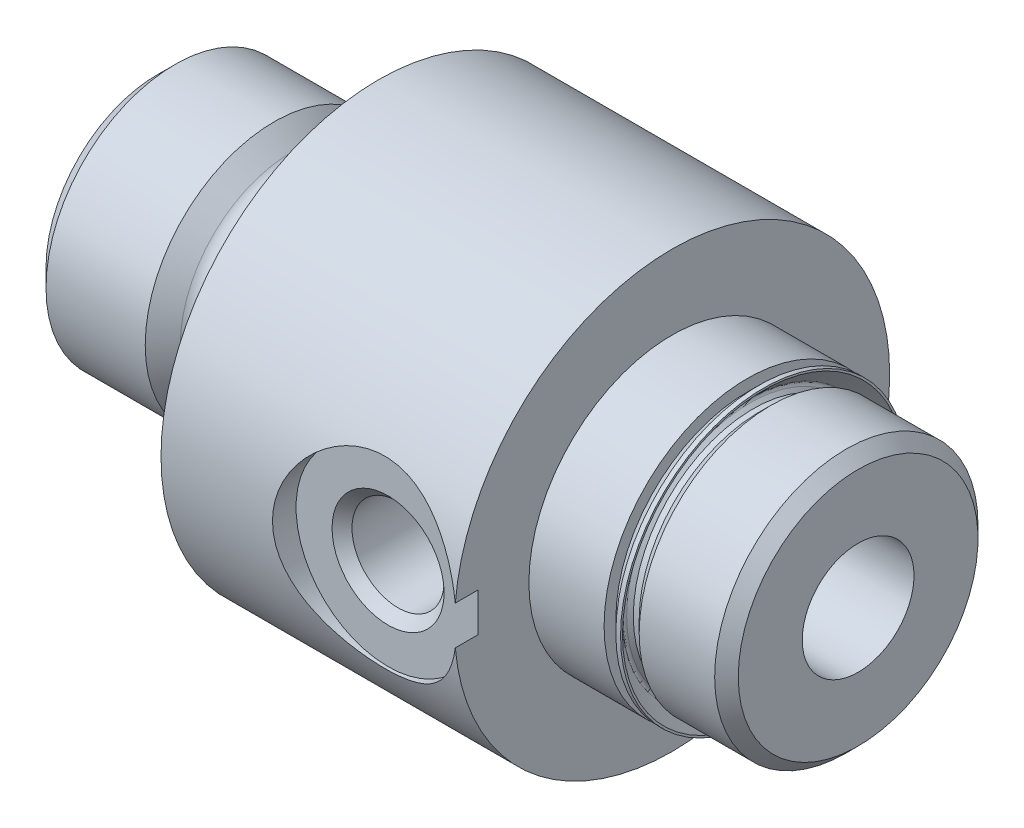
ISO-10303-21;
HEADER;
FILE_DESCRIPTION(('STEP AP214'),'2;1');
FILE_NAME('part.step','',(''),(''),'','','');
FILE_SCHEMA(('AUTOMOTIVE_DESIGN { 1 0 10303 214 1 1 1 1 }'));
ENDSEC;
DATA;
#1=APPLICATION_CONTEXT('core data for automotive mechanical design processes');
#2=APPLICATION_PROTOCOL_DEFINITION('international standard','automotive_design',2000,#1);
#3=PRODUCT_CONTEXT('',#1,'mechanical');
#4=PRODUCT('Part','Part','',(#3));
#5=PRODUCT_RELATED_PRODUCT_CATEGORY('part','',(#4));
#6=PRODUCT_DEFINITION_FORMATION('','',#4);
#7=PRODUCT_DEFINITION_CONTEXT('part definition',#1,'design');
#8=PRODUCT_DEFINITION('design','',#6,#7);
#9=PRODUCT_DEFINITION_SHAPE('','',#8);
#10=(LENGTH_UNIT() NAMED_UNIT(*) SI_UNIT(.MILLI.,.METRE.));
#11=(NAMED_UNIT(*) PLANE_ANGLE_UNIT() SI_UNIT($,.RADIAN.));
#12=(NAMED_UNIT(*) SI_UNIT($,.STERADIAN.) SOLID_ANGLE_UNIT());
#13=UNCERTAINTY_MEASURE_WITH_UNIT(LENGTH_MEASURE(1.E-05),#10,'distance_accuracy_value','');
#14=(GEOMETRIC_REPRESENTATION_CONTEXT(3) GLOBAL_UNCERTAINTY_ASSIGNED_CONTEXT((#13)) GLOBAL_UNIT_ASSIGNED_CONTEXT((#10,
#11,#12)) REPRESENTATION_CONTEXT('',''));
#15=CARTESIAN_POINT('',(0.,0.,0.));
#16=DIRECTION('',(0.,0.,1.));
#17=DIRECTION('',(1.,0.,0.));
#18=AXIS2_PLACEMENT_3D('',#15,#16,#17);
#19=CARTESIAN_POINT('',(25.4,9.3726,0.));
#20=DIRECTION('',(-1.,0.,0.));
#21=DIRECTION('',(0.,0.,1.));
#22=AXIS2_PLACEMENT_3D('',#19,#20,#21);
#23=PLANE('',#22);
#24=CARTESIAN_POINT('',(25.4,0.,0.));
#25=DIRECTION('',(-1.,0.,0.));
#26=DIRECTION('',(0.,0.,1.));
#27=AXIS2_PLACEMENT_3D('',#24,#25,#26);
#28=CIRCLE('',#27,6.16585);
#29=CARTESIAN_POINT('',(25.4,0.,6.16585));
#30=VERTEX_POINT('',#29);
#31=EDGE_CURVE('E555',#30,#30,#28,.T.);
#32=ORIENTED_EDGE('',*,*,#31,.F.);
#33=EDGE_LOOP('',(#32));
#34=FACE_BOUND('',#33,.T.);
#35=CARTESIAN_POINT('',(25.4,0.,0.));
#36=DIRECTION('',(-1.,0.,0.));
#37=DIRECTION('',(0.,0.,1.));
#38=AXIS2_PLACEMENT_3D('',#35,#36,#37);
#39=CIRCLE('',#38,5.6603386855597);
#40=CARTESIAN_POINT('',(25.4,0.,5.6603386855597));
#41=VERTEX_POINT('',#40);
#42=EDGE_CURVE('E11',#41,#41,#39,.F.);
#43=ORIENTED_EDGE('',*,*,#42,.F.);
#44=EDGE_LOOP('',(#43));
#45=FACE_BOUND('',#44,.T.);
#46=ADVANCED_FACE('F38',(#34,#45),#23,.F.);
#47=CARTESIAN_POINT('',(30.1752,0.,0.));
#48=DIRECTION('',(-1.,0.,0.));
#49=DIRECTION('',(0.,0.,1.));
#50=AXIS2_PLACEMENT_3D('',#47,#48,#49);
#51=CYLINDRICAL_SURFACE('',#50,5.16255);
#52=CARTESIAN_POINT('',(25.908,0.,0.));
#53=DIRECTION('',(-1.,0.,0.));
#54=DIRECTION('',(0.,0.,1.));
#55=AXIS2_PLACEMENT_3D('',#52,#53,#54);
#56=CIRCLE('',#55,5.16255);
#57=CARTESIAN_POINT('',(25.908,0.,5.16255));
#58=VERTEX_POINT('',#57);
#59=EDGE_CURVE('E106',#58,#58,#56,.T.);
#60=ORIENTED_EDGE('',*,*,#59,.T.);
#61=EDGE_LOOP('',(#60));
#62=FACE_BOUND('',#61,.T.);
#63=CARTESIAN_POINT('',(25.654,0.,0.));
#64=DIRECTION('',(-1.,0.,0.));
#65=DIRECTION('',(0.,0.,1.));
#66=AXIS2_PLACEMENT_3D('',#63,#64,#65);
#67=CIRCLE('',#66,5.16255);
#68=CARTESIAN_POINT('',(25.654,0.,5.16255));
#69=VERTEX_POINT('',#68);
#70=EDGE_CURVE('E46',#69,#69,#67,.T.);
#71=ORIENTED_EDGE('',*,*,#70,.F.);
#72=EDGE_LOOP('',(#71));
#73=FACE_BOUND('',#72,.T.);
#74=ADVANCED_FACE('F172',(#62,#73),#51,.T.);
#75=CARTESIAN_POINT('',(30.1752,0.,0.));
#76=DIRECTION('',(-1.,0.,0.));
#77=DIRECTION('',(0.,0.,1.));
#78=AXIS2_PLACEMENT_3D('',#75,#76,#77);
#79=CYLINDRICAL_SURFACE('',#78,9.3726);
#80=CARTESIAN_POINT('',(9.525,0.,0.));
#81=DIRECTION('',(-1.,0.,0.));
#82=DIRECTION('',(0.,0.,1.));
#83=AXIS2_PLACEMENT_3D('',#80,#81,#82);
#84=CIRCLE('',#83,9.3726);
#85=CARTESIAN_POINT('',(9.525,0.,9.3726));
#86=VERTEX_POINT('',#85);
#87=EDGE_CURVE('E109',#86,#86,#84,.T.);
#88=ORIENTED_EDGE('',*,*,#87,.F.);
#89=EDGE_LOOP('',(#88));
#90=FACE_BOUND('',#89,.T.);
#91=CARTESIAN_POINT('',(22.1615,0.,0.));
#92=DIRECTION('',(1.,0.,0.));
#93=DIRECTION('',(0.,0.,-1.));
#94=AXIS2_PLACEMENT_3D('',#91,#92,#93);
#95=CIRCLE('',#94,9.3726);
#96=CARTESIAN_POINT('',(22.1615,-0.834632559872902,9.33536390560111));
#97=VERTEX_POINT('',#96);
#98=CARTESIAN_POINT('',(22.1615,0.834632559872902,9.33536390560111));
#99=VERTEX_POINT('',#98);
#100=EDGE_CURVE('E75',#97,#99,#95,.T.);
#101=ORIENTED_EDGE('',*,*,#100,.F.);
#102=CARTESIAN_POINT('',(14.3256,0.,9.3726));
#103=CARTESIAN_POINT('',(14.3256007847787,-0.106034358499214,9.37259937566318));
#104=CARTESIAN_POINT('',(14.3298622196159,-0.212102984455135,9.3707955936407));
#105=CARTESIAN_POINT('',(14.3468664680338,-0.423481617946176,9.36362607527876));
#106=CARTESIAN_POINT('',(14.3596145368135,-0.528791114534977,9.35825813190039));
#107=CARTESIAN_POINT('',(14.3934972849969,-0.738045737542348,9.34408523623956));
#108=CARTESIAN_POINT('',(14.4146488451403,-0.84198767998823,9.33527336646095));
#109=CARTESIAN_POINT('',(14.4651133095554,-1.047556732083,9.31444901697212));
#110=CARTESIAN_POINT('',(14.4944295496022,-1.1491828771877,9.30243522916746));
#111=CARTESIAN_POINT('',(14.5939808234609,-1.44876024555991,9.26213021499638));
#112=CARTESIAN_POINT('',(14.6759760866631,-1.64236835016573,9.22950628484626));
#113=CARTESIAN_POINT('',(14.8685029131907,-2.01278792665281,9.15587800701386));
#114=CARTESIAN_POINT('',(14.979026299258,-2.18960419188745,9.11487606149391));
#115=CARTESIAN_POINT('',(15.2315103799277,-2.53092785028021,9.0262144176742));
#116=CARTESIAN_POINT('',(15.3747035281306,-2.69446744951661,8.97833250538193));
#117=CARTESIAN_POINT('',(15.6858004227496,-2.99602975720291,8.88225999999363));
#118=CARTESIAN_POINT('',(15.8537174498351,-3.1340386611286,8.83406925439525));
#119=CARTESIAN_POINT('',(16.2200529949637,-3.38765546632028,8.74006169142934));
#120=CARTESIAN_POINT('',(16.4195903327512,-3.50176196649314,8.69449128629245));
#121=CARTESIAN_POINT('',(16.7325555755937,-3.64615779691065,8.63445846738749));
#122=CARTESIAN_POINT('',(16.8391976361349,-3.68984076712222,8.61582908095398));
#123=CARTESIAN_POINT('',(17.0563468923013,-3.76788097151651,8.58198791739158));
#124=CARTESIAN_POINT('',(17.1668520476474,-3.80224304694113,8.56677436679898));
#125=CARTESIAN_POINT('',(17.3854286113833,-3.85980930448531,8.54098642274406));
#126=CARTESIAN_POINT('',(17.4933563264975,-3.88347550429939,8.53022213383807));
#127=CARTESIAN_POINT('',(17.7110852655598,-3.92173317835287,8.51270133791138));
#128=CARTESIAN_POINT('',(17.8208855914741,-3.93632888334405,8.50594296248014));
#129=CARTESIAN_POINT('',(18.0414720758414,-3.95627332770152,8.49668487493681));
#130=CARTESIAN_POINT('',(18.1522579532592,-3.96162462325051,8.49418398558494));
#131=CARTESIAN_POINT('',(18.3738964256704,-3.96301861503271,8.49353371249745));
#132=CARTESIAN_POINT('',(18.4847490166587,-3.9590618232777,8.49538408941088));
#133=CARTESIAN_POINT('',(18.6967776343397,-3.94257539486705,8.50304680977758));
#134=CARTESIAN_POINT('',(18.7980210434599,-3.93075379546559,8.50853179372387));
#135=CARTESIAN_POINT('',(18.9990690659652,-3.89940546186072,8.52294286471688));
#136=CARTESIAN_POINT('',(19.0988731989767,-3.87987621414305,8.53187007427391));
#137=CARTESIAN_POINT('',(19.395064425887,-3.8099975930247,8.56342436671249));
#138=CARTESIAN_POINT('',(19.5884041149146,-3.74834347940313,8.59083110661853));
#139=CARTESIAN_POINT('',(19.9659678905179,-3.59548234527021,8.65592932275785));
#140=CARTESIAN_POINT('',(20.1499054263505,-3.50366659560753,8.69382987529455));
#141=CARTESIAN_POINT('',(20.5005201427297,-3.2935027659072,8.77560090245237));
#142=CARTESIAN_POINT('',(20.6671903667937,-3.17514405280551,8.81947376679529));
#143=CARTESIAN_POINT('',(20.9938083360205,-2.90314174689628,8.91290064288197));
#144=CARTESIAN_POINT('',(21.1519008510761,-2.74732059971406,8.96261635498035));
#145=CARTESIAN_POINT('',(21.4403457825917,-2.41089919834485,9.05890665358331));
#146=CARTESIAN_POINT('',(21.5706913156109,-2.23029281369719,9.10548045869415));
#147=CARTESIAN_POINT('',(21.80276908749,-1.84365060297926,9.19166489143267));
#148=CARTESIAN_POINT('',(21.9037256425793,-1.63710186384783,9.23107791130031));
#149=CARTESIAN_POINT('',(22.0688038134091,-1.20785984604516,9.29697422744739));
#150=CARTESIAN_POINT('',(22.1329464027726,-0.985175841556649,9.32346488455126));
#151=CARTESIAN_POINT('',(22.2186447532593,-0.545464501651219,9.35914407576109));
#152=CARTESIAN_POINT('',(22.2426880380652,-0.329003802639671,9.3693414330515));
#153=CARTESIAN_POINT('',(22.2549478079582,0.105082870642388,9.37452109542313));
#154=CARTESIAN_POINT('',(22.2431749678006,0.322708478420073,9.36950793389846));
#155=CARTESIAN_POINT('',(22.1858986104506,0.74115718387465,9.34548143638236));
#156=CARTESIAN_POINT('',(22.1421605486744,0.9422688774786,9.32720120121325));
#157=CARTESIAN_POINT('',(22.0246723649868,1.33406825074195,9.2792711223997));
#158=CARTESIAN_POINT('',(21.9509184796571,1.52475461986018,9.24961985306888));
#159=CARTESIAN_POINT('',(21.7730918070278,1.89700591684725,9.18063010098873));
#160=CARTESIAN_POINT('',(21.6681457193431,2.07810133208088,9.1410185012849));
#161=CARTESIAN_POINT('',(21.4318603483895,2.42076517973475,9.05630886266345));
#162=CARTESIAN_POINT('',(21.300509911422,2.58232531373687,9.01120850837924));
#163=CARTESIAN_POINT('',(21.003904789252,2.89380065179376,8.91627603472376));
#164=CARTESIAN_POINT('',(20.8368681781874,3.04198825237481,8.86633971574651));
#165=CARTESIAN_POINT('',(20.4794060261673,3.30877984848916,8.77027752301089));
#166=CARTESIAN_POINT('',(20.2889745970776,3.42737637352229,8.72415261343456));
#167=CARTESIAN_POINT('',(19.9877123420964,3.58114963365137,8.66164675652079));
#168=CARTESIAN_POINT('',(19.8837424689045,3.62868320436492,8.64178649774071));
#169=CARTESIAN_POINT('',(19.6716285884866,3.71473583311274,8.60514713930564));
#170=CARTESIAN_POINT('',(19.5634864517969,3.7532588773318,8.5883666778831));
#171=CARTESIAN_POINT('',(19.3438523618734,3.82086248256759,8.5585050094943));
#172=CARTESIAN_POINT('',(19.2323620641027,3.84994762873044,8.54542200661824));
#173=CARTESIAN_POINT('',(19.0068747033238,3.89834886124254,8.52345096572075));
#174=CARTESIAN_POINT('',(18.8928778871937,3.91766590523833,8.5145625164788));
#175=CARTESIAN_POINT('',(18.6724421910215,3.94514427064224,8.50186310792561));
#176=CARTESIAN_POINT('',(18.5661174435465,3.95406614678074,8.4977065856986));
#177=CARTESIAN_POINT('',(18.3529758820266,3.96330349290157,8.49340229610692));
#178=CARTESIAN_POINT('',(18.2461589153982,3.96361608542046,8.49325586902833));
#179=CARTESIAN_POINT('',(18.0329711152585,3.95562145805438,8.49698249796804));
#180=CARTESIAN_POINT('',(17.926600073458,3.94731885439651,8.50085340140526));
#181=CARTESIAN_POINT('',(17.7150678249933,3.9222096307706,8.51246621756775));
#182=CARTESIAN_POINT('',(17.6099070895817,3.90539980579485,8.52020958919237));
#183=CARTESIAN_POINT('',(17.3078223601974,3.84454501999023,8.54792993887305));
#184=CARTESIAN_POINT('',(17.1134072337252,3.7896017896873,8.57264650225012));
#185=CARTESIAN_POINT('',(16.7366412962004,3.65161072464814,8.63232020298238));
#186=CARTESIAN_POINT('',(16.5542939130555,3.56855494500744,8.66728023487472));
#187=CARTESIAN_POINT('',(16.1945160861522,3.37084095678001,8.74614398831467));
#188=CARTESIAN_POINT('',(16.0180666548569,3.25456202561234,8.7904636297753));
#189=CARTESIAN_POINT('',(15.686257122934,2.99597602169914,8.88192435734578));
#190=CARTESIAN_POINT('',(15.5309047121298,2.85365950243174,8.92906646326531));
#191=CARTESIAN_POINT('',(15.2334666352567,2.5340734747181,9.02518056300412));
#192=CARTESIAN_POINT('',(15.0932831239778,2.35497080112409,9.07401983200871));
#193=CARTESIAN_POINT('',(14.9070655804226,2.0695103371712,9.14179442064448));
#194=CARTESIAN_POINT('',(14.8489648991632,1.97146837114246,9.16348744685256));
#195=CARTESIAN_POINT('',(14.7412523341999,1.77036195605496,9.20445279877424));
#196=CARTESIAN_POINT('',(14.6916365298898,1.66729985508876,9.22372624140392));
#197=CARTESIAN_POINT('',(14.6020348722108,1.45842374574955,9.25903268180572));
#198=CARTESIAN_POINT('',(14.5619152103807,1.35267458075306,9.27511012065244));
#199=CARTESIAN_POINT('',(14.4907756491453,1.1377620524598,9.3039169912351));
#200=CARTESIAN_POINT('',(14.4597514188693,1.02860034156869,9.31664801609623));
#201=CARTESIAN_POINT('',(14.407191081519,0.807941947314301,9.33836834936601));
#202=CARTESIAN_POINT('',(14.3856316981371,0.696451706531074,9.34736683393452));
#203=CARTESIAN_POINT('',(14.352157718539,0.471841882197909,9.36139082530379));
#204=CARTESIAN_POINT('',(14.3402361248841,0.358723541560575,9.36641921449781));
#205=CARTESIAN_POINT('',(14.3306672475396,0.204467796659971,9.37045872790099));
#206=CARTESIAN_POINT('',(14.3287675903542,0.163603255935182,9.3712612309043));
#207=CARTESIAN_POINT('',(14.3262338123357,0.0818275111064659,9.37233198860922));
#208=CARTESIAN_POINT('',(14.3255996971713,0.040916306794336,9.37260024091773));
#209=CARTESIAN_POINT('',(14.3256,0.,9.3726));
#210=B_SPLINE_CURVE_WITH_KNOTS('',3,(#102,#103,#104,#105,#106,#107,#108,#109,#110,#111,#112,
#113,#114,#115,#116,#117,#118,#119,#120,#121,#122,#123,#124,#125,#126,#127,#128,#129,#130,#131,
#132,#133,#134,#135,#136,#137,#138,#139,#140,#141,#142,#143,#144,#145,#146,#147,#148,#149,#150,
#151,#152,#153,#154,#155,#156,#157,#158,#159,#160,#161,#162,#163,#164,#165,#166,#167,#168,#169,
#170,#171,#172,#173,#174,#175,#176,#177,#178,#179,#180,#181,#182,#183,#184,#185,#186,#187,#188,
#189,#190,#191,#192,#193,#194,#195,#196,#197,#198,#199,#200,#201,#202,#203,#204,#205,#206,#207,
#208,#209),.UNSPECIFIED.,.T.,.F.,(4,2,2,2,2,2,2,2,2,2,2,2,2,2,2,2,2,2,2,2,2,2,2,2,2,2,2,2,2,2,2,
2,2,2,2,2,2,2,2,2,2,2,2,2,2,2,2,2,2,2,2,2,2,4),(0.,0.31806136029308,0.636319857927257,
0.955220924765885,1.27425247397355,1.90943264637467,2.54443095348157,3.20924541455145,
3.8744182988083,4.5735147959008,4.92333301990614,5.27296920005555,5.60557252582808,
5.9380205987319,6.27037673129926,6.60271458231539,6.90857783121968,7.21454090664446,
7.82595016004589,8.45054656629703,9.07539363314262,9.7547569718634,10.4342886503873,
11.1303992868044,11.8261129409511,12.476800477427,13.1272940998562,13.744341268528,
14.3614658271275,14.9978241714309,15.6344518925947,16.317852194927,17.0014248528782,
17.3491378472873,17.6966967240738,18.0440864951456,18.3914422021649,18.711364938466,
19.0313946005989,19.3512528717289,19.6712317359617,20.2789144211783,20.8867689875549,
21.5317600350213,22.1769855530572,22.8711881202821,23.2188606756693,23.5663721454022,
23.9086486211141,24.2507618531424,24.5920289689755,24.9330480875174,25.055780361164,
25.1785131845749),.UNSPECIFIED.);
#211=EDGE_CURVE('E68',#99,#97,#210,.T.);
#212=ORIENTED_EDGE('',*,*,#211,.F.);
#213=EDGE_LOOP('',(#101,#212));
#214=FACE_BOUND('',#213,.T.);
#215=ADVANCED_FACE('F178',(#90,#214),#79,.T.);
#216=CARTESIAN_POINT('',(18.288,0.,9.3726));
#217=DIRECTION('',(0.,0.,-1.));
#218=DIRECTION('',(-1.,0.,0.));
#219=AXIS2_PLACEMENT_3D('',#216,#217,#218);
#220=CYLINDRICAL_SURFACE('',#219,3.9624);
#221=ORIENTED_EDGE('',*,*,#211,.T.);
#222=DIRECTION('',(0.,0.,-1.));
#223=VECTOR('',#222,1.);
#224=CARTESIAN_POINT('',(22.1615,-0.834632559872902,9.3726));
#225=LINE('',#224,#223);
#226=CARTESIAN_POINT('',(22.1615,-0.834632559872902,8.3566));
#227=VERTEX_POINT('',#226);
#228=EDGE_CURVE('E58',#97,#227,#225,.T.);
#229=ORIENTED_EDGE('',*,*,#228,.T.);
#230=CARTESIAN_POINT('',(18.288,0.,8.3566));
#231=DIRECTION('',(0.,0.,-1.));
#232=DIRECTION('',(-1.,0.,0.));
#233=AXIS2_PLACEMENT_3D('',#230,#231,#232);
#234=CIRCLE('',#233,3.9624);
#235=CARTESIAN_POINT('',(22.1615,0.834632559872902,8.3566));
#236=VERTEX_POINT('',#235);
#237=EDGE_CURVE('E73',#227,#236,#234,.T.);
#238=ORIENTED_EDGE('',*,*,#237,.T.);
#239=DIRECTION('',(0.,0.,-1.));
#240=VECTOR('',#239,1.);
#241=CARTESIAN_POINT('',(22.1615,0.834632559872902,9.3726));
#242=LINE('',#241,#240);
#243=EDGE_CURVE('E53',#236,#99,#242,.F.);
#244=ORIENTED_EDGE('',*,*,#243,.T.);
#245=EDGE_LOOP('',(#221,#229,#238,#244));
#246=FACE_BOUND('',#245,.T.);
#247=ADVANCED_FACE('F72',(#246),#220,.F.);
#248=CARTESIAN_POINT('',(20.701,0.,8.3566));
#249=DIRECTION('',(0.,0.,1.));
#250=DIRECTION('',(1.,0.,0.));
#251=AXIS2_PLACEMENT_3D('',#248,#249,#250);
#252=PLANE('',#251);
#253=CARTESIAN_POINT('',(18.288,0.,8.3566));
#254=DIRECTION('',(0.,0.,-1.));
#255=DIRECTION('',(-1.,0.,0.));
#256=AXIS2_PLACEMENT_3D('',#253,#254,#255);
#257=CIRCLE('',#256,2.413);
#258=CARTESIAN_POINT('',(15.875,0.,8.3566));
#259=VERTEX_POINT('',#258);
#260=EDGE_CURVE('E78',#259,#259,#257,.T.);
#261=ORIENTED_EDGE('',*,*,#260,.T.);
#262=EDGE_LOOP('',(#261));
#263=FACE_BOUND('',#262,.T.);
#264=ORIENTED_EDGE('',*,*,#237,.F.);
#265=DIRECTION('',(0.,1.,0.));
#266=VECTOR('',#265,1.);
#267=CARTESIAN_POINT('',(22.1615,0.,8.3566));
#268=LINE('',#267,#266);
#269=EDGE_CURVE('E63',#227,#236,#268,.T.);
#270=ORIENTED_EDGE('',*,*,#269,.T.);
#271=EDGE_LOOP('',(#264,#270));
#272=FACE_BOUND('',#271,.T.);
#273=ADVANCED_FACE('F77',(#263,#272),#252,.T.);
#274=CARTESIAN_POINT('',(0.,0.,0.));
#275=DIRECTION('',(-1.,0.,0.));
#276=DIRECTION('',(0.,0.,1.));
#277=AXIS2_PLACEMENT_3D('',#274,#275,#276);
#278=CYLINDRICAL_SURFACE('',#277,2.40665);
#279=CARTESIAN_POINT('',(0.507999999999998,0.,0.));
#280=DIRECTION('',(-1.,0.,0.));
#281=DIRECTION('',(0.,0.,1.));
#282=AXIS2_PLACEMENT_3D('',#279,#280,#281);
#283=CIRCLE('',#282,2.40665);
#284=CARTESIAN_POINT('',(0.507999999999998,0.,2.40665));
#285=VERTEX_POINT('',#284);
#286=EDGE_CURVE('E91',#285,#285,#283,.T.);
#287=ORIENTED_EDGE('',*,*,#286,.T.);
#288=EDGE_LOOP('',(#287));
#289=FACE_BOUND('',#288,.T.);
#290=CARTESIAN_POINT('',(30.1752,0.,0.));
#291=DIRECTION('',(-1.,0.,0.));
#292=DIRECTION('',(0.,0.,1.));
#293=AXIS2_PLACEMENT_3D('',#290,#291,#292);
#294=CIRCLE('',#293,2.40665);
#295=CARTESIAN_POINT('',(30.1752,0.,2.40665));
#296=VERTEX_POINT('',#295);
#297=EDGE_CURVE('E94',#296,#296,#294,.T.);
#298=ORIENTED_EDGE('',*,*,#297,.F.);
#299=EDGE_LOOP('',(#298));
#300=FACE_BOUND('',#299,.T.);
#301=CARTESIAN_POINT('',(20.27174,0.,2.40665));
#302=CARTESIAN_POINT('',(20.271732083611,-0.0944665266148716,2.40664227817569));
#303=CARTESIAN_POINT('',(20.264938281244,-0.189022688118429,2.40103400474687));
#304=CARTESIAN_POINT('',(20.2382407274094,-0.375036425841801,2.37910138201514));
#305=CARTESIAN_POINT('',(20.2183171046315,-0.466489084126016,2.36276079002454));
#306=CARTESIAN_POINT('',(20.1668351040403,-0.643131246397744,2.32089161849654));
#307=CARTESIAN_POINT('',(20.1353493880645,-0.728355963070287,2.2954204433231));
#308=CARTESIAN_POINT('',(20.0623471352527,-0.891585964550188,2.2370893523968));
#309=CARTESIAN_POINT('',(20.0208287598189,-0.969589922444067,2.20422808240251));
#310=CARTESIAN_POINT('',(19.9126422340187,-1.14447786819001,2.12005822248041));
#311=CARTESIAN_POINT('',(19.84231266377,-1.23795870823166,2.06638022030208));
#312=CARTESIAN_POINT('',(19.6885321536435,-1.40964208958544,1.95332961471516));
#313=CARTESIAN_POINT('',(19.605044209136,-1.48780010470502,1.89394114145529));
#314=CARTESIAN_POINT('',(19.4247395722244,-1.62986684612,1.7732117342424));
#315=CARTESIAN_POINT('',(19.3277125761668,-1.69349798625319,1.71185485552847));
#316=CARTESIAN_POINT('',(19.1731185392029,-1.77628372716905,1.62431828701695));
#317=CARTESIAN_POINT('',(19.1201234563902,-1.80175375812465,1.59590978250623));
#318=CARTESIAN_POINT('',(19.0109356834055,-1.84827208038185,1.54179133245285));
#319=CARTESIAN_POINT('',(18.9547457937074,-1.86932417063162,1.51607907802767));
#320=CARTESIAN_POINT('',(18.8327470222155,-1.90866811307985,1.46630957139255));
#321=CARTESIAN_POINT('',(18.7665560734158,-1.92641232979909,1.44273489310753));
#322=CARTESIAN_POINT('',(18.6305316382863,-1.9551740221339,1.40351601713772));
#323=CARTESIAN_POINT('',(18.5607076586563,-1.96620818141848,1.38785216681842));
#324=CARTESIAN_POINT('',(18.4178340368811,-1.98079801512445,1.36696168575298));
#325=CARTESIAN_POINT('',(18.3447571077889,-1.98426892569323,1.36185338708202));
#326=CARTESIAN_POINT('',(18.1988046589964,-1.98307846450031,1.36358448122014));
#327=CARTESIAN_POINT('',(18.1259292089748,-1.97841456417784,1.37042758891142));
#328=CARTESIAN_POINT('',(17.975358232337,-1.96057100804832,1.39584227330882));
#329=CARTESIAN_POINT('',(17.8979733448864,-1.94653915010945,1.41558282154709));
#330=CARTESIAN_POINT('',(17.7479520114763,-1.91038435433696,1.46400011383435));
#331=CARTESIAN_POINT('',(17.6753317190683,-1.88823541539069,1.49270553050759));
#332=CARTESIAN_POINT('',(17.5504563216836,-1.84246025373771,1.54864974648624));
#333=CARTESIAN_POINT('',(17.4972078363799,-1.82020377099369,1.57484894727814));
#334=CARTESIAN_POINT('',(17.3936774155696,-1.77163222700846,1.62930009150415));
#335=CARTESIAN_POINT('',(17.3433971377681,-1.74531492695382,1.65755316270792));
#336=CARTESIAN_POINT('',(17.1967539967516,-1.66047944683466,1.74392035275729));
#337=CARTESIAN_POINT('',(17.1046436972852,-1.59609827564095,1.80361560683221));
#338=CARTESIAN_POINT('',(16.9281467643951,-1.44906291232317,1.92396686313827));
#339=CARTESIAN_POINT('',(16.8442769958811,-1.36573038709953,1.9845499210859));
#340=CARTESIAN_POINT('',(16.6909520146864,-1.18272201505033,2.09873888418448));
#341=CARTESIAN_POINT('',(16.6214630753337,-1.08308541207721,2.15236100172848));
#342=CARTESIAN_POINT('',(16.5160741514393,-0.896539089550014,2.23510750096794));
#343=CARTESIAN_POINT('',(16.4761431391089,-0.813124249591007,2.26697037376801));
#344=CARTESIAN_POINT('',(16.4076816971062,-0.639025927690315,2.32205095802317));
#345=CARTESIAN_POINT('',(16.3791434707341,-0.548347467837317,2.34527458103991));
#346=CARTESIAN_POINT('',(16.3350298297872,-0.361153707750085,2.38131666245983));
#347=CARTESIAN_POINT('',(16.3195444689695,-0.264602707750542,2.39406282048912));
#348=CARTESIAN_POINT('',(16.3030634922475,-0.0694466223280627,2.40763145906262));
#349=CARTESIAN_POINT('',(16.3020606714073,0.0291574172724828,2.40845986858087));
#350=CARTESIAN_POINT('',(16.3139132332596,0.21415061193982,2.39869783182771));
#351=CARTESIAN_POINT('',(16.3252819807325,0.3007077594501,2.38933231574157));
#352=CARTESIAN_POINT('',(16.3588599806674,0.470225803750748,2.36182736715262));
#353=CARTESIAN_POINT('',(16.3810709939627,0.553186114014716,2.34368650949867));
#354=CARTESIAN_POINT('',(16.4359440489433,0.71604040424665,2.29925727846078));
#355=CARTESIAN_POINT('',(16.4688874866116,0.795778263179254,2.27275021016908));
#356=CARTESIAN_POINT('',(16.5435922139962,0.948418008217707,2.21341031580642));
#357=CARTESIAN_POINT('',(16.5853563085294,1.02131770923345,2.18057547790508));
#358=CARTESIAN_POINT('',(16.697055807937,1.19105315632743,2.09429288698658));
#359=CARTESIAN_POINT('',(16.7711901083829,1.2838056936711,2.0382382445847));
#360=CARTESIAN_POINT('',(16.9328595831294,1.45349214275559,1.92093559938729));
#361=CARTESIAN_POINT('',(17.0204427413482,1.53036700592303,1.85966936589485));
#362=CARTESIAN_POINT('',(17.1616439843106,1.63402087437716,1.76752305857778));
#363=CARTESIAN_POINT('',(17.2108246226197,1.66686404186151,1.73649331187815));
#364=CARTESIAN_POINT('',(17.3124015352713,1.72828206801288,1.67537418004322));
#365=CARTESIAN_POINT('',(17.3647992056835,1.75685505484699,1.64528521184142));
#366=CARTESIAN_POINT('',(17.4726836163731,1.80943932818475,1.58726815784958));
#367=CARTESIAN_POINT('',(17.528157725088,1.83346770643541,1.55933221966486));
#368=CARTESIAN_POINT('',(17.6424600335993,1.87676116983256,1.50694542358347));
#369=CARTESIAN_POINT('',(17.7012842166922,1.8960318174011,1.48249051021143));
#370=CARTESIAN_POINT('',(17.825373240103,1.93016564151887,1.43779577359627));
#371=CARTESIAN_POINT('',(17.8908128397301,1.94476259320278,1.41782539771858));
#372=CARTESIAN_POINT('',(18.024711682745,1.96735573238081,1.38631208874035));
#373=CARTESIAN_POINT('',(18.0931625289769,1.97536918445334,1.37474712253859));
#374=CARTESIAN_POINT('',(18.2321033893806,1.98418004009116,1.36200770781594));
#375=CARTESIAN_POINT('',(18.3026052773875,1.98491965668776,1.36091646944212));
#376=CARTESIAN_POINT('',(18.4426514778706,1.9789483704062,1.3695792977153));
#377=CARTESIAN_POINT('',(18.5121944964069,1.97222823997276,1.37934679642153));
#378=CARTESIAN_POINT('',(18.6630348304667,1.94976722089614,1.41096104936784));
#379=CARTESIAN_POINT('',(18.7436138232841,1.9323871649794,1.43496662881897));
#380=CARTESIAN_POINT('',(18.899256953179,1.88895874150638,1.49166492915252));
#381=CARTESIAN_POINT('',(18.9743026224266,1.86288282018877,1.52438519622516));
#382=CARTESIAN_POINT('',(19.1025994005462,1.80978657569381,1.58679762915181));
#383=CARTESIAN_POINT('',(19.1569701594641,1.78428280615955,1.61552942833153));
#384=CARTESIAN_POINT('',(19.2625017162326,1.72890790823878,1.67466021726516));
#385=CARTESIAN_POINT('',(19.3136608537093,1.69903454696595,1.70506005440322));
#386=CARTESIAN_POINT('',(19.4625462907843,1.6030103066942,1.7972672208547));
#387=CARTESIAN_POINT('',(19.5556438657573,1.53047074497561,1.86006282937338));
#388=CARTESIAN_POINT('',(19.7312375957919,1.36642939143608,1.98387238608034));
#389=CARTESIAN_POINT('',(19.8133570710222,1.27444710289374,2.04478491474355));
#390=CARTESIAN_POINT('',(19.9610444876563,1.07313156133466,2.15720649367432));
#391=CARTESIAN_POINT('',(20.0266590916067,0.963848680969043,2.20874193788446));
#392=CARTESIAN_POINT('',(20.1198306276474,0.766506294150987,2.28294317814053));
#393=CARTESIAN_POINT('',(20.1528709505076,0.682517432180877,2.30959577774668));
#394=CARTESIAN_POINT('',(20.2075478948831,0.508730545312789,2.35396352401006));
#395=CARTESIAN_POINT('',(20.2292089739206,0.418945448928532,2.37169783529599));
#396=CARTESIAN_POINT('',(20.2535274333724,0.273697126945266,2.39165514743912));
#397=CARTESIAN_POINT('',(20.2603379912707,0.219350815547061,2.39725889761492));
#398=CARTESIAN_POINT('',(20.2694471404593,0.110013243381814,2.40475903316864));
#399=CARTESIAN_POINT('',(20.2717446108838,0.055021825807398,2.40665449756001));
#400=CARTESIAN_POINT('',(20.27174,0.,2.40665));
#401=B_SPLINE_CURVE_WITH_KNOTS('',3,(#301,#302,#303,#304,#305,#306,#307,#308,#309,#310,#311,
#312,#313,#314,#315,#316,#317,#318,#319,#320,#321,#322,#323,#324,#325,#326,#327,#328,#329,#330,
#331,#332,#333,#334,#335,#336,#337,#338,#339,#340,#341,#342,#343,#344,#345,#346,#347,#348,#349,
#350,#351,#352,#353,#354,#355,#356,#357,#358,#359,#360,#361,#362,#363,#364,#365,#366,#367,#368,
#369,#370,#371,#372,#373,#374,#375,#376,#377,#378,#379,#380,#381,#382,#383,#384,#385,#386,#387,
#388,#389,#390,#391,#392,#393,#394,#395,#396,#397,#398,#399,#400),.UNSPECIFIED.,.T.,.F.,(4,2,2,
2,2,2,2,2,2,2,2,2,2,2,2,2,2,2,2,2,2,2,2,2,2,2,2,2,2,2,2,2,2,2,2,2,2,2,2,2,2,2,2,2,2,2,2,2,2,4),
(0.,0.283162935535792,0.566755410899832,0.848595329630821,1.13048693792319,1.51454143646914,
1.89969592462705,2.29168773357921,2.48737635412505,2.68289600795077,2.89963805865165,
3.1158389817749,3.33445073977213,3.55313046144226,3.79504647792913,4.03774428584481,
4.2276411801509,4.41764314514185,4.79783827153697,5.1947306981822,5.59068149129777,
5.88299485013139,6.17510781876932,6.46921999834795,6.76318585466661,7.02536792513003,
7.28759258932971,7.55733585643207,7.8271650267367,8.21901226255657,8.61229151981616,
8.8124732149721,9.01274240396692,9.21224273713692,9.41150871137877,9.62066475518131,
9.82927054116323,10.039532269227,10.2500543768851,10.5061945172443,10.7631541005878,
10.962623516766,11.1621952213783,11.5614701021252,11.9720972208077,12.3815500259933,
12.6627814245088,12.9434058706648,13.1082925691995,13.2732202136516),.UNSPECIFIED.);
#402=CARTESIAN_POINT('',(20.27174,0.,2.40665));
#403=VERTEX_POINT('',#402);
#404=EDGE_CURVE('E87',#403,#403,#401,.T.);
#405=ORIENTED_EDGE('',*,*,#404,.F.);
#406=EDGE_LOOP('',(#405));
#407=FACE_BOUND('',#406,.T.);
#408=ADVANCED_FACE('F149',(#289,#300,#407),#278,.F.);
#409=CARTESIAN_POINT('',(9.525,0.,0.));
#410=DIRECTION('',(-1.,0.,0.));
#411=DIRECTION('',(0.,0.,1.));
#412=AXIS2_PLACEMENT_3D('',#409,#410,#411);
#413=CYLINDRICAL_SURFACE('',#412,5.5245);
#414=CARTESIAN_POINT('',(8.3185,0.,0.));
#415=DIRECTION('',(-1.,0.,0.));
#416=DIRECTION('',(0.,0.,1.));
#417=AXIS2_PLACEMENT_3D('',#414,#415,#416);
#418=CIRCLE('',#417,5.5245);
#419=CARTESIAN_POINT('',(8.3185,0.,5.5245));
#420=VERTEX_POINT('',#419);
#421=EDGE_CURVE('E136',#420,#420,#418,.T.);
#422=ORIENTED_EDGE('',*,*,#421,.F.);
#423=EDGE_LOOP('',(#422));
#424=FACE_BOUND('',#423,.T.);
#425=CARTESIAN_POINT('',(9.525,0.,0.));
#426=DIRECTION('',(1.,0.,0.));
#427=DIRECTION('',(0.,0.,-1.));
#428=AXIS2_PLACEMENT_3D('',#425,#426,#427);
#429=CIRCLE('',#428,5.5245);
#430=CARTESIAN_POINT('',(9.525,0.,-5.5245));
#431=VERTEX_POINT('',#430);
#432=EDGE_CURVE('E112',#431,#431,#429,.T.);
#433=ORIENTED_EDGE('',*,*,#432,.F.);
#434=EDGE_LOOP('',(#433));
#435=FACE_BOUND('',#434,.T.);
#436=ADVANCED_FACE('F40',(#424,#435),#413,.T.);
#437=CARTESIAN_POINT('',(8.3185,5.37209999999986,0.));
#438=DIRECTION('',(1.,0.,0.));
#439=DIRECTION('',(0.,0.,-1.));
#440=AXIS2_PLACEMENT_3D('',#437,#438,#439);
#441=PLANE('',#440);
#442=CARTESIAN_POINT('',(8.3185,0.,0.));
#443=DIRECTION('',(-1.,0.,0.));
#444=DIRECTION('',(0.,0.,1.));
#445=AXIS2_PLACEMENT_3D('',#442,#443,#444);
#446=CIRCLE('',#445,5.37209999999986);
#447=CARTESIAN_POINT('',(8.3185,0.,5.37209999999986));
#448=VERTEX_POINT('',#447);
#449=EDGE_CURVE('E133',#448,#448,#446,.T.);
#450=ORIENTED_EDGE('',*,*,#449,.F.);
#451=EDGE_LOOP('',(#450));
#452=FACE_BOUND('',#451,.T.);
#453=ORIENTED_EDGE('',*,*,#421,.T.);
#454=EDGE_LOOP('',(#453));
#455=FACE_BOUND('',#454,.T.);
#456=ADVANCED_FACE('F219',(#452,#455),#441,.F.);
#457=CARTESIAN_POINT('',(7.51840000000014,0.,0.));
#458=DIRECTION('',(-1.,0.,0.));
#459=DIRECTION('',(0.,0.,1.));
#460=AXIS2_PLACEMENT_3D('',#457,#458,#459);
#461=TOROIDAL_SURFACE('',#460,5.37209999999986,0.800099999999857);
#462=CARTESIAN_POINT('',(7.51840000000014,0.,0.));
#463=DIRECTION('',(-1.,0.,0.));
#464=DIRECTION('',(0.,0.,1.));
#465=AXIS2_PLACEMENT_3D('',#462,#463,#464);
#466=CIRCLE('',#465,4.572);
#467=CARTESIAN_POINT('',(7.51840000000014,0.,4.572));
#468=VERTEX_POINT('',#467);
#469=EDGE_CURVE('E130',#468,#468,#466,.T.);
#470=ORIENTED_EDGE('',*,*,#469,.F.);
#471=EDGE_LOOP('',(#470));
#472=FACE_BOUND('',#471,.T.);
#473=ORIENTED_EDGE('',*,*,#449,.T.);
#474=EDGE_LOOP('',(#473));
#475=FACE_BOUND('',#474,.T.);
#476=ADVANCED_FACE('F216',(#472,#475),#461,.F.);
#477=CARTESIAN_POINT('',(9.525,0.,0.));
#478=DIRECTION('',(-1.,0.,0.));
#479=DIRECTION('',(0.,0.,1.));
#480=AXIS2_PLACEMENT_3D('',#477,#478,#479);
#481=CYLINDRICAL_SURFACE('',#480,4.572);
#482=CARTESIAN_POINT('',(6.35,0.,0.));
#483=DIRECTION('',(-1.,0.,0.));
#484=DIRECTION('',(0.,0.,1.));
#485=AXIS2_PLACEMENT_3D('',#482,#483,#484);
#486=CIRCLE('',#485,4.572);
#487=CARTESIAN_POINT('',(6.35,0.,4.572));
#488=VERTEX_POINT('',#487);
#489=EDGE_CURVE('E127',#488,#488,#486,.T.);
#490=ORIENTED_EDGE('',*,*,#489,.F.);
#491=EDGE_LOOP('',(#490));
#492=FACE_BOUND('',#491,.T.);
#493=ORIENTED_EDGE('',*,*,#469,.T.);
#494=EDGE_LOOP('',(#493));
#495=FACE_BOUND('',#494,.T.);
#496=ADVANCED_FACE('F212',(#492,#495),#481,.T.);
#497=CARTESIAN_POINT('',(6.35000000000007,0.,0.));
#498=DIRECTION('',(-1.,0.,0.));
#499=DIRECTION('',(0.,0.,1.));
#500=AXIS2_PLACEMENT_3D('',#497,#498,#499);
#501=TOROIDAL_SURFACE('',#500,5.37210000000021,0.800100000000209);
#502=CARTESIAN_POINT('',(5.78640329137171,0.,0.));
#503=DIRECTION('',(-1.,0.,0.));
#504=DIRECTION('',(0.,0.,1.));
#505=AXIS2_PLACEMENT_3D('',#502,#503,#504);
#506=CIRCLE('',#505,4.80419264838059);
#507=CARTESIAN_POINT('',(5.78640329137171,0.,4.80419264838059));
#508=VERTEX_POINT('',#507);
#509=EDGE_CURVE('E124',#508,#508,#506,.T.);
#510=ORIENTED_EDGE('',*,*,#509,.F.);
#511=EDGE_LOOP('',(#510));
#512=FACE_BOUND('',#511,.T.);
#513=ORIENTED_EDGE('',*,*,#489,.T.);
#514=EDGE_LOOP('',(#513));
#515=FACE_BOUND('',#514,.T.);
#516=ADVANCED_FACE('F208',(#512,#515),#501,.F.);
#517=CARTESIAN_POINT('',(5.78640329137171,0.,0.));
#518=DIRECTION('',(-1.,0.,0.));
#519=DIRECTION('',(0.,0.,1.));
#520=AXIS2_PLACEMENT_3D('',#517,#518,#519);
#521=CONICAL_SURFACE('',#520,4.80419264838059,0.781588524273101);
#522=CARTESIAN_POINT('',(5.0285938643726,0.,0.));
#523=DIRECTION('',(-1.,0.,0.));
#524=DIRECTION('',(0.,0.,1.));
#525=AXIS2_PLACEMENT_3D('',#522,#523,#524);
#526=CIRCLE('',#525,5.55625);
#527=CARTESIAN_POINT('',(5.0285938643726,0.,5.55625));
#528=VERTEX_POINT('',#527);
#529=EDGE_CURVE('E121',#528,#528,#526,.T.);
#530=ORIENTED_EDGE('',*,*,#529,.F.);
#531=EDGE_LOOP('',(#530));
#532=FACE_BOUND('',#531,.T.);
#533=ORIENTED_EDGE('',*,*,#509,.T.);
#534=EDGE_LOOP('',(#533));
#535=FACE_BOUND('',#534,.T.);
#536=ADVANCED_FACE('F204',(#532,#535),#521,.T.);
#537=CARTESIAN_POINT('',(9.525,0.,0.));
#538=DIRECTION('',(-1.,0.,0.));
#539=DIRECTION('',(0.,0.,1.));
#540=AXIS2_PLACEMENT_3D('',#537,#538,#539);
#541=CYLINDRICAL_SURFACE('',#540,5.55625);
#542=CARTESIAN_POINT('',(0.75565,0.,0.));
#543=DIRECTION('',(-1.,0.,0.));
#544=DIRECTION('',(0.,0.,1.));
#545=AXIS2_PLACEMENT_3D('',#542,#543,#544);
#546=CIRCLE('',#545,5.55625);
#547=CARTESIAN_POINT('',(0.75565,0.,5.55625));
#548=VERTEX_POINT('',#547);
#549=EDGE_CURVE('E118',#548,#548,#546,.T.);
#550=ORIENTED_EDGE('',*,*,#549,.F.);
#551=EDGE_LOOP('',(#550));
#552=FACE_BOUND('',#551,.T.);
#553=ORIENTED_EDGE('',*,*,#529,.T.);
#554=EDGE_LOOP('',(#553));
#555=FACE_BOUND('',#554,.T.);
#556=ADVANCED_FACE('F200',(#552,#555),#541,.T.);
#557=CARTESIAN_POINT('',(0.75565,0.,0.));
#558=DIRECTION('',(1.,0.,0.));
#559=DIRECTION('',(0.,0.,-1.));
#560=AXIS2_PLACEMENT_3D('',#557,#558,#559);
#561=CONICAL_SURFACE('',#560,5.55625,0.785398163397448);
#562=CARTESIAN_POINT('',(0.,0.,0.));
#563=DIRECTION('',(-1.,0.,0.));
#564=DIRECTION('',(0.,0.,1.));
#565=AXIS2_PLACEMENT_3D('',#562,#563,#564);
#566=CIRCLE('',#565,4.8006);
#567=CARTESIAN_POINT('',(0.,0.,4.8006));
#568=VERTEX_POINT('',#567);
#569=EDGE_CURVE('E115',#568,#568,#566,.T.);
#570=ORIENTED_EDGE('',*,*,#569,.F.);
#571=EDGE_LOOP('',(#570));
#572=FACE_BOUND('',#571,.T.);
#573=ORIENTED_EDGE('',*,*,#549,.T.);
#574=EDGE_LOOP('',(#573));
#575=FACE_BOUND('',#574,.T.);
#576=ADVANCED_FACE('F196',(#572,#575),#561,.T.);
#577=CARTESIAN_POINT('',(0.,0.,0.));
#578=DIRECTION('',(1.,0.,0.));
#579=DIRECTION('',(0.,0.,-1.));
#580=AXIS2_PLACEMENT_3D('',#577,#578,#579);
#581=PLANE('',#580);
#582=CARTESIAN_POINT('',(0.,0.,0.));
#583=DIRECTION('',(-1.,0.,0.));
#584=DIRECTION('',(0.,0.,1.));
#585=AXIS2_PLACEMENT_3D('',#582,#583,#584);
#586=CIRCLE('',#585,2.91465);
#587=CARTESIAN_POINT('',(0.,0.,2.91465));
#588=VERTEX_POINT('',#587);
#589=EDGE_CURVE('E88',#588,#588,#586,.T.);
#590=ORIENTED_EDGE('',*,*,#589,.F.);
#591=EDGE_LOOP('',(#590));
#592=FACE_BOUND('',#591,.T.);
#593=ORIENTED_EDGE('',*,*,#569,.T.);
#594=EDGE_LOOP('',(#593));
#595=FACE_BOUND('',#594,.T.);
#596=ADVANCED_FACE('F192',(#592,#595),#581,.F.);
#597=CARTESIAN_POINT('',(9.525,0.,0.));
#598=DIRECTION('',(1.,0.,0.));
#599=DIRECTION('',(0.,0.,-1.));
#600=AXIS2_PLACEMENT_3D('',#597,#598,#599);
#601=PLANE('',#600);
#602=ORIENTED_EDGE('',*,*,#87,.T.);
#603=EDGE_LOOP('',(#602));
#604=FACE_BOUND('',#603,.T.);
#605=ORIENTED_EDGE('',*,*,#432,.T.);
#606=EDGE_LOOP('',(#605));
#607=FACE_BOUND('',#606,.T.);
#608=ADVANCED_FACE('F188',(#604,#607),#601,.F.);
#609=CARTESIAN_POINT('',(26.416,0.,0.));
#610=DIRECTION('',(1.,0.,0.));
#611=DIRECTION('',(0.,0.,-1.));
#612=AXIS2_PLACEMENT_3D('',#609,#610,#611);
#613=CONICAL_SURFACE('',#612,5.67055,0.785398163397448);
#614=ORIENTED_EDGE('',*,*,#59,.F.);
#615=EDGE_LOOP('',(#614));
#616=FACE_BOUND('',#615,.T.);
#617=CARTESIAN_POINT('',(26.416,0.,0.));
#618=DIRECTION('',(-1.,0.,0.));
#619=DIRECTION('',(0.,0.,1.));
#620=AXIS2_PLACEMENT_3D('',#617,#618,#619);
#621=CIRCLE('',#620,5.67055);
#622=CARTESIAN_POINT('',(26.416,0.,5.67055));
#623=VERTEX_POINT('',#622);
#624=EDGE_CURVE('E103',#623,#623,#621,.T.);
#625=ORIENTED_EDGE('',*,*,#624,.T.);
#626=EDGE_LOOP('',(#625));
#627=FACE_BOUND('',#626,.T.);
#628=ADVANCED_FACE('F191',(#616,#627),#613,.T.);
#629=CARTESIAN_POINT('',(30.1752,0.,0.));
#630=DIRECTION('',(-1.,0.,0.));
#631=DIRECTION('',(0.,0.,1.));
#632=AXIS2_PLACEMENT_3D('',#629,#630,#631);
#633=CYLINDRICAL_SURFACE('',#632,5.67055);
#634=ORIENTED_EDGE('',*,*,#624,.F.);
#635=EDGE_LOOP('',(#634));
#636=FACE_BOUND('',#635,.T.);
#637=CARTESIAN_POINT('',(29.6672,0.,0.));
#638=DIRECTION('',(-1.,0.,0.));
#639=DIRECTION('',(0.,0.,1.));
#640=AXIS2_PLACEMENT_3D('',#637,#638,#639);
#641=CIRCLE('',#640,5.67055);
#642=CARTESIAN_POINT('',(29.6672,0.,5.67055));
#643=VERTEX_POINT('',#642);
#644=EDGE_CURVE('E100',#643,#643,#641,.T.);
#645=ORIENTED_EDGE('',*,*,#644,.T.);
#646=EDGE_LOOP('',(#645));
#647=FACE_BOUND('',#646,.T.);
#648=ADVANCED_FACE('F251',(#636,#647),#633,.T.);
#649=CARTESIAN_POINT('',(30.1752,0.,0.));
#650=DIRECTION('',(-1.,0.,0.));
#651=DIRECTION('',(0.,0.,1.));
#652=AXIS2_PLACEMENT_3D('',#649,#650,#651);
#653=CONICAL_SURFACE('',#652,5.16255,0.785398163397451);
#654=ORIENTED_EDGE('',*,*,#644,.F.);
#655=EDGE_LOOP('',(#654));
#656=FACE_BOUND('',#655,.T.);
#657=CARTESIAN_POINT('',(30.1752,0.,0.));
#658=DIRECTION('',(-1.,0.,0.));
#659=DIRECTION('',(0.,0.,1.));
#660=AXIS2_PLACEMENT_3D('',#657,#658,#659);
#661=CIRCLE('',#660,5.16255);
#662=CARTESIAN_POINT('',(30.1752,0.,5.16255));
#663=VERTEX_POINT('',#662);
#664=EDGE_CURVE('E97',#663,#663,#661,.T.);
#665=ORIENTED_EDGE('',*,*,#664,.T.);
#666=EDGE_LOOP('',(#665));
#667=FACE_BOUND('',#666,.T.);
#668=ADVANCED_FACE('F167',(#656,#667),#653,.T.);
#669=CARTESIAN_POINT('',(30.1752,5.16255,0.));
#670=DIRECTION('',(-1.,0.,0.));
#671=DIRECTION('',(0.,0.,1.));
#672=AXIS2_PLACEMENT_3D('',#669,#670,#671);
#673=PLANE('',#672);
#674=ORIENTED_EDGE('',*,*,#297,.T.);
#675=EDGE_LOOP('',(#674));
#676=FACE_BOUND('',#675,.T.);
#677=ORIENTED_EDGE('',*,*,#664,.F.);
#678=EDGE_LOOP('',(#677));
#679=FACE_BOUND('',#678,.T.);
#680=ADVANCED_FACE('F162',(#676,#679),#673,.F.);
#681=CARTESIAN_POINT('',(0.,0.,0.));
#682=DIRECTION('',(-1.,0.,0.));
#683=DIRECTION('',(0.,0.,1.));
#684=AXIS2_PLACEMENT_3D('',#681,#682,#683);
#685=CONICAL_SURFACE('',#684,2.91465,0.785398163397447);
#686=ORIENTED_EDGE('',*,*,#286,.F.);
#687=EDGE_LOOP('',(#686));
#688=FACE_BOUND('',#687,.T.);
#689=ORIENTED_EDGE('',*,*,#589,.T.);
#690=EDGE_LOOP('',(#689));
#691=FACE_BOUND('',#690,.T.);
#692=ADVANCED_FACE('F158',(#688,#691),#685,.F.);
#693=CARTESIAN_POINT('',(18.288,0.,9.3726));
#694=DIRECTION('',(0.,0.,-1.));
#695=DIRECTION('',(-1.,0.,0.));
#696=AXIS2_PLACEMENT_3D('',#693,#694,#695);
#697=CYLINDRICAL_SURFACE('',#696,1.98374);
#698=CARTESIAN_POINT('',(18.288,0.,7.92734));
#699=DIRECTION('',(0.,0.,-1.));
#700=DIRECTION('',(-1.,0.,0.));
#701=AXIS2_PLACEMENT_3D('',#698,#699,#700);
#702=CIRCLE('',#701,1.98374);
#703=CARTESIAN_POINT('',(16.30426,0.,7.92734));
#704=VERTEX_POINT('',#703);
#705=EDGE_CURVE('E81',#704,#704,#702,.T.);
#706=ORIENTED_EDGE('',*,*,#705,.F.);
#707=EDGE_LOOP('',(#706));
#708=FACE_BOUND('',#707,.T.);
#709=ORIENTED_EDGE('',*,*,#404,.T.);
#710=EDGE_LOOP('',(#709));
#711=FACE_BOUND('',#710,.T.);
#712=ADVANCED_FACE('F153',(#708,#711),#697,.F.);
#713=CARTESIAN_POINT('',(18.288,0.,8.3566));
#714=DIRECTION('',(0.,0.,1.));
#715=DIRECTION('',(1.,0.,0.));
#716=AXIS2_PLACEMENT_3D('',#713,#714,#715);
#717=CONICAL_SURFACE('',#716,2.413,0.785398163397448);
#718=ORIENTED_EDGE('',*,*,#705,.T.);
#719=EDGE_LOOP('',(#718));
#720=FACE_BOUND('',#719,.T.);
#721=ORIENTED_EDGE('',*,*,#260,.F.);
#722=EDGE_LOOP('',(#721));
#723=FACE_BOUND('',#722,.T.);
#724=ADVANCED_FACE('F157',(#720,#723),#717,.F.);
#725=CARTESIAN_POINT('',(22.1615,9.97585,0.));
#726=DIRECTION('',(1.,0.,0.));
#727=DIRECTION('',(0.,0.,-1.));
#728=AXIS2_PLACEMENT_3D('',#725,#726,#727);
#729=PLANE('',#728);
#730=CARTESIAN_POINT('',(22.1615,0.,0.));
#731=DIRECTION('',(-1.,0.,0.));
#732=DIRECTION('',(0.,0.,1.));
#733=AXIS2_PLACEMENT_3D('',#730,#731,#732);
#734=CIRCLE('',#733,6.16585);
#735=CARTESIAN_POINT('',(22.1615,0.,6.16585));
#736=VERTEX_POINT('',#735);
#737=EDGE_CURVE('E553',#736,#736,#734,.T.);
#738=ORIENTED_EDGE('',*,*,#737,.T.);
#739=EDGE_LOOP('',(#738));
#740=FACE_BOUND('',#739,.T.);
#741=ORIENTED_EDGE('',*,*,#100,.T.);
#742=ORIENTED_EDGE('',*,*,#243,.F.);
#743=ORIENTED_EDGE('',*,*,#269,.F.);
#744=ORIENTED_EDGE('',*,*,#228,.F.);
#745=EDGE_LOOP('',(#741,#742,#743,#744));
#746=FACE_BOUND('',#745,.T.);
#747=ADVANCED_FACE('F64',(#740,#746),#729,.T.);
#748=CARTESIAN_POINT('',(25.4,0.,0.));
#749=DIRECTION('',(-1.,0.,0.));
#750=DIRECTION('',(0.,0.,1.));
#751=AXIS2_PLACEMENT_3D('',#748,#749,#750);
#752=CYLINDRICAL_SURFACE('',#751,6.16585);
#753=ORIENTED_EDGE('',*,*,#31,.T.);
#754=EDGE_LOOP('',(#753));
#755=FACE_BOUND('',#754,.T.);
#756=ORIENTED_EDGE('',*,*,#737,.F.);
#757=EDGE_LOOP('',(#756));
#758=FACE_BOUND('',#757,.T.);
#759=ADVANCED_FACE('F299',(#755,#758),#752,.T.);
#760=CARTESIAN_POINT('',(25.90551131444,0.,0.));
#761=DIRECTION('',(1.,0.,0.));
#762=DIRECTION('',(0.,0.,-1.));
#763=AXIS2_PLACEMENT_3D('',#760,#761,#762);
#764=CONICAL_SURFACE('',#763,6.16585,0.785398163397743);
#765=ORIENTED_EDGE('',*,*,#42,.T.);
#766=EDGE_LOOP('',(#765));
#767=FACE_BOUND('',#766,.T.);
#768=CARTESIAN_POINT('',(25.90551131444,0.,0.));
#769=DIRECTION('',(-1.,0.,0.));
#770=DIRECTION('',(0.,0.,1.));
#771=AXIS2_PLACEMENT_3D('',#768,#769,#770);
#772=CIRCLE('',#771,6.16585);
#773=CARTESIAN_POINT('',(25.90551131444,0.,6.16585));
#774=VERTEX_POINT('',#773);
#775=EDGE_CURVE('E559',#774,#774,#772,.T.);
#776=ORIENTED_EDGE('',*,*,#775,.T.);
#777=EDGE_LOOP('',(#776));
#778=FACE_BOUND('',#777,.T.);
#779=ADVANCED_FACE('F295',(#767,#778),#764,.T.);
#780=CARTESIAN_POINT('',(25.908,0.,0.));
#781=DIRECTION('',(-1.,0.,0.));
#782=DIRECTION('',(0.,0.,1.));
#783=AXIS2_PLACEMENT_3D('',#780,#781,#782);
#784=CYLINDRICAL_SURFACE('',#783,6.16585);
#785=ORIENTED_EDGE('',*,*,#775,.F.);
#786=EDGE_LOOP('',(#785));
#787=FACE_BOUND('',#786,.T.);
#788=CARTESIAN_POINT('',(26.10871131444,0.,0.));
#789=DIRECTION('',(-1.,0.,0.));
#790=DIRECTION('',(0.,0.,1.));
#791=AXIS2_PLACEMENT_3D('',#788,#789,#790);
#792=CIRCLE('',#791,6.16585);
#793=CARTESIAN_POINT('',(26.10871131444,0.,6.16585));
#794=VERTEX_POINT('',#793);
#795=EDGE_CURVE('E564',#794,#794,#792,.T.);
#796=ORIENTED_EDGE('',*,*,#795,.T.);
#797=EDGE_LOOP('',(#796));
#798=FACE_BOUND('',#797,.T.);
#799=ADVANCED_FACE('F291',(#787,#798),#784,.T.);
#800=CARTESIAN_POINT('',(26.10871131444,6.0816818041258,0.));
#801=DIRECTION('',(-1.,0.,0.));
#802=DIRECTION('',(0.,0.,1.));
#803=AXIS2_PLACEMENT_3D('',#800,#801,#802);
#804=PLANE('',#803);
#805=ORIENTED_EDGE('',*,*,#795,.F.);
#806=EDGE_LOOP('',(#805));
#807=FACE_BOUND('',#806,.T.);
#808=CARTESIAN_POINT('',(26.10871131444,0.,0.));
#809=DIRECTION('',(-1.,0.,0.));
#810=DIRECTION('',(0.,0.,1.));
#811=AXIS2_PLACEMENT_3D('',#808,#809,#810);
#812=CIRCLE('',#811,6.0816818041258);
#813=CARTESIAN_POINT('',(26.10871131444,0.,6.0816818041258));
#814=VERTEX_POINT('',#813);
#815=EDGE_CURVE('E567',#814,#814,#812,.T.);
#816=ORIENTED_EDGE('',*,*,#815,.T.);
#817=EDGE_LOOP('',(#816));
#818=FACE_BOUND('',#817,.T.);
#819=ADVANCED_FACE('F287',(#807,#818),#804,.F.);
#820=CARTESIAN_POINT('',(25.5115923163685,0.,0.));
#821=DIRECTION('',(1.,0.,0.));
#822=DIRECTION('',(0.,0.,-1.));
#823=AXIS2_PLACEMENT_3D('',#820,#821,#822);
#824=CONICAL_SURFACE('',#823,5.48456280605401,0.785398163397655);
#825=ORIENTED_EDGE('',*,*,#815,.F.);
#826=EDGE_LOOP('',(#825));
#827=FACE_BOUND('',#826,.T.);
#828=CARTESIAN_POINT('',(25.5115923163685,0.,0.));
#829=DIRECTION('',(-1.,0.,0.));
#830=DIRECTION('',(0.,0.,1.));
#831=AXIS2_PLACEMENT_3D('',#828,#829,#830);
#832=CIRCLE('',#831,5.48456280605401);
#833=CARTESIAN_POINT('',(25.5115923163685,0.,5.48456280605401));
#834=VERTEX_POINT('',#833);
#835=EDGE_CURVE('E570',#834,#834,#832,.T.);
#836=ORIENTED_EDGE('',*,*,#835,.T.);
#837=EDGE_LOOP('',(#836));
#838=FACE_BOUND('',#837,.T.);
#839=ADVANCED_FACE('F280',(#827,#838),#824,.F.);
#840=CARTESIAN_POINT('',(25.6013948775798,0.,0.));
#841=DIRECTION('',(-1.,0.,0.));
#842=DIRECTION('',(0.,0.,1.));
#843=AXIS2_PLACEMENT_3D('',#840,#841,#842);
#844=TOROIDAL_SURFACE('',#843,5.3947602448428,0.127000000000809);
#845=ORIENTED_EDGE('',*,*,#835,.F.);
#846=EDGE_LOOP('',(#845));
#847=FACE_BOUND('',#846,.T.);
#848=CARTESIAN_POINT('',(25.5115923163685,0.,0.));
#849=DIRECTION('',(-1.,0.,0.));
#850=DIRECTION('',(0.,0.,1.));
#851=AXIS2_PLACEMENT_3D('',#848,#849,#850);
#852=CIRCLE('',#851,5.30495768363151);
#853=CARTESIAN_POINT('',(25.5115923163685,0.,5.30495768363151));
#854=VERTEX_POINT('',#853);
#855=EDGE_CURVE('E573',#854,#854,#852,.T.);
#856=ORIENTED_EDGE('',*,*,#855,.T.);
#857=EDGE_LOOP('',(#856));
#858=FACE_BOUND('',#857,.T.);
#859=ADVANCED_FACE('F274',(#847,#858),#844,.F.);
#860=CARTESIAN_POINT('',(25.654,0.,0.));
#861=DIRECTION('',(-1.,0.,0.));
#862=DIRECTION('',(0.,0.,1.));
#863=AXIS2_PLACEMENT_3D('',#860,#861,#862);
#864=CONICAL_SURFACE('',#863,5.16255,0.785398163397439);
#865=ORIENTED_EDGE('',*,*,#855,.F.);
#866=EDGE_LOOP('',(#865));
#867=FACE_BOUND('',#866,.T.);
#868=ORIENTED_EDGE('',*,*,#70,.T.);
#869=EDGE_LOOP('',(#868));
#870=FACE_BOUND('',#869,.T.);
#871=ADVANCED_FACE('F272',(#867,#870),#864,.T.);
#872=CLOSED_SHELL('',(#46,#74,#215,#247,#273,#408,#436,#456,#476,#496,#516,#536,#556,#576,#596,
#608,#628,#648,#668,#680,#692,#712,#724,#747,#759,#779,#799,#819,#839,#859,#871));
#873=MANIFOLD_SOLID_BREP('B2',#872);
#874=ADVANCED_BREP_SHAPE_REPRESENTATION('',(#18,#873),#14);
#875=SHAPE_DEFINITION_REPRESENTATION(#9,#874);
ENDSEC;
END-ISO-10303-21;
